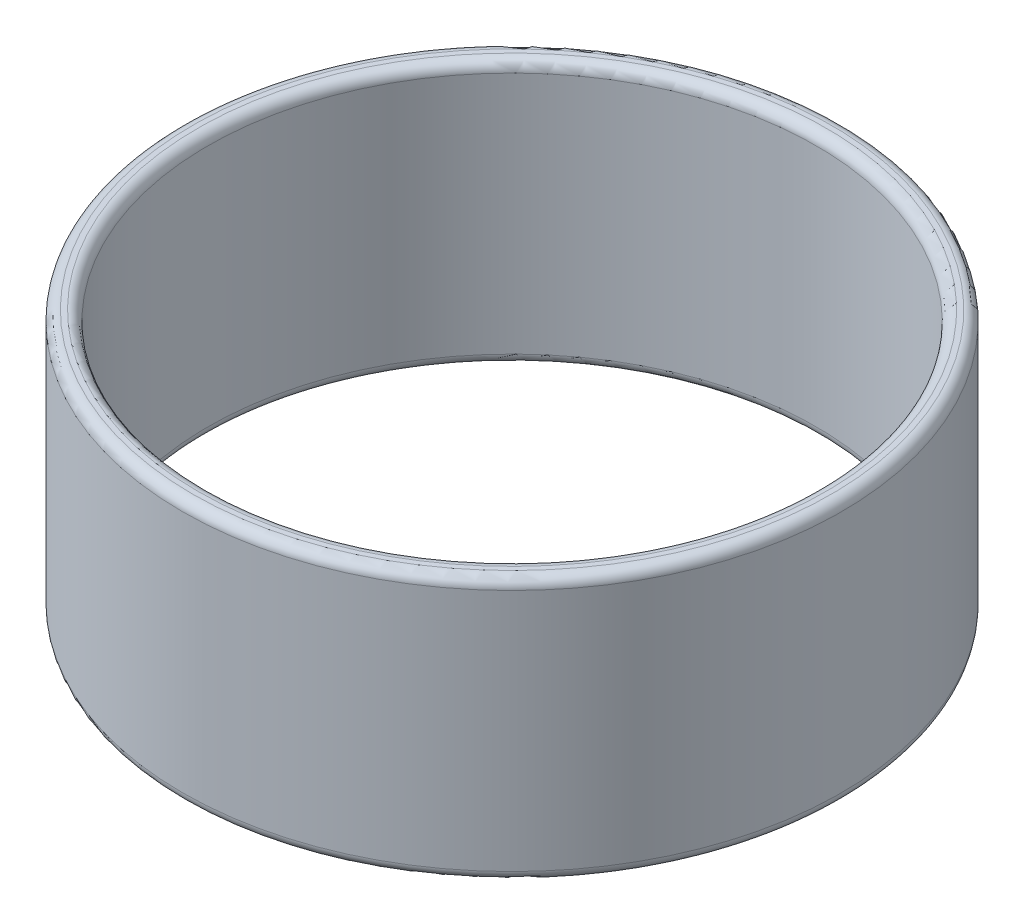
ISO-10303-21;
HEADER;
FILE_DESCRIPTION(('STEP AP214'),'2;1');
FILE_NAME('part.step','',(''),(''),'','','');
FILE_SCHEMA(('AUTOMOTIVE_DESIGN { 1 0 10303 214 1 1 1 1 }'));
ENDSEC;
DATA;
#1=APPLICATION_CONTEXT('core data for automotive mechanical design processes');
#2=APPLICATION_PROTOCOL_DEFINITION('international standard','automotive_design',2000,#1);
#3=PRODUCT_CONTEXT('',#1,'mechanical');
#4=PRODUCT('Part','Part','',(#3));
#5=PRODUCT_RELATED_PRODUCT_CATEGORY('part','',(#4));
#6=PRODUCT_DEFINITION_FORMATION('','',#4);
#7=PRODUCT_DEFINITION_CONTEXT('part definition',#1,'design');
#8=PRODUCT_DEFINITION('design','',#6,#7);
#9=PRODUCT_DEFINITION_SHAPE('','',#8);
#10=(LENGTH_UNIT() NAMED_UNIT(*) SI_UNIT(.MILLI.,.METRE.));
#11=(NAMED_UNIT(*) PLANE_ANGLE_UNIT() SI_UNIT($,.RADIAN.));
#12=(NAMED_UNIT(*) SI_UNIT($,.STERADIAN.) SOLID_ANGLE_UNIT());
#13=UNCERTAINTY_MEASURE_WITH_UNIT(LENGTH_MEASURE(1.E-05),#10,'distance_accuracy_value','');
#14=(GEOMETRIC_REPRESENTATION_CONTEXT(3) GLOBAL_UNCERTAINTY_ASSIGNED_CONTEXT((#13)) GLOBAL_UNIT_ASSIGNED_CONTEXT((#10,
#11,#12)) REPRESENTATION_CONTEXT('',''));
#15=CARTESIAN_POINT('',(0.,0.,0.));
#16=DIRECTION('',(0.,0.,1.));
#17=DIRECTION('',(1.,0.,0.));
#18=AXIS2_PLACEMENT_3D('',#15,#16,#17);
#19=CARTESIAN_POINT('',(0.,26.,0.));
#20=DIRECTION('',(0.,1.,0.));
#21=DIRECTION('',(0.,0.,1.));
#22=AXIS2_PLACEMENT_3D('',#19,#20,#21);
#23=PLANE('',#22);
#24=CARTESIAN_POINT('',(0.,26.,0.));
#25=DIRECTION('',(0.,1.,0.));
#26=DIRECTION('',(0.,0.,1.));
#27=AXIS2_PLACEMENT_3D('',#24,#25,#26);
#28=CIRCLE('',#27,31.);
#29=CARTESIAN_POINT('',(0.,26.,31.));
#30=VERTEX_POINT('',#29);
#31=EDGE_CURVE('E10',#30,#30,#28,.F.);
#32=ORIENTED_EDGE('',*,*,#31,.T.);
#33=EDGE_LOOP('',(#32));
#34=FACE_BOUND('',#33,.T.);
#35=CARTESIAN_POINT('',(0.,26.,0.));
#36=DIRECTION('',(0.,1.,0.));
#37=DIRECTION('',(0.,0.,1.));
#38=AXIS2_PLACEMENT_3D('',#35,#36,#37);
#39=CIRCLE('',#38,31.5);
#40=CARTESIAN_POINT('',(0.,26.,31.5));
#41=VERTEX_POINT('',#40);
#42=EDGE_CURVE('E39',#41,#41,#39,.T.);
#43=ORIENTED_EDGE('',*,*,#42,.T.);
#44=EDGE_LOOP('',(#43));
#45=FACE_BOUND('',#44,.T.);
#46=ADVANCED_FACE('F32',(#34,#45),#23,.T.);
#47=CARTESIAN_POINT('',(0.,0.,0.));
#48=DIRECTION('',(0.,1.,0.));
#49=DIRECTION('',(0.,0.,1.));
#50=AXIS2_PLACEMENT_3D('',#47,#48,#49);
#51=PLANE('',#50);
#52=CARTESIAN_POINT('',(0.,0.,0.));
#53=DIRECTION('',(0.,1.,0.));
#54=DIRECTION('',(0.,0.,1.));
#55=AXIS2_PLACEMENT_3D('',#52,#53,#54);
#56=CIRCLE('',#55,31.);
#57=CARTESIAN_POINT('',(0.,0.,31.));
#58=VERTEX_POINT('',#57);
#59=EDGE_CURVE('E58',#58,#58,#56,.T.);
#60=ORIENTED_EDGE('',*,*,#59,.T.);
#61=EDGE_LOOP('',(#60));
#62=FACE_BOUND('',#61,.T.);
#63=CARTESIAN_POINT('',(0.,0.,0.));
#64=DIRECTION('',(0.,1.,0.));
#65=DIRECTION('',(0.,0.,1.));
#66=AXIS2_PLACEMENT_3D('',#63,#64,#65);
#67=CIRCLE('',#66,31.5);
#68=CARTESIAN_POINT('',(0.,0.,31.5));
#69=VERTEX_POINT('',#68);
#70=EDGE_CURVE('E61',#69,#69,#67,.F.);
#71=ORIENTED_EDGE('',*,*,#70,.T.);
#72=EDGE_LOOP('',(#71));
#73=FACE_BOUND('',#72,.T.);
#74=ADVANCED_FACE('F65',(#62,#73),#51,.F.);
#75=CARTESIAN_POINT('',(0.,26.,0.));
#76=DIRECTION('',(0.,-1.,0.));
#77=DIRECTION('',(0.,0.,-1.));
#78=AXIS2_PLACEMENT_3D('',#75,#76,#77);
#79=CYLINDRICAL_SURFACE('',#78,32.5);
#80=CARTESIAN_POINT('',(0.,1.,0.));
#81=DIRECTION('',(0.,1.,0.));
#82=DIRECTION('',(0.,0.,1.));
#83=AXIS2_PLACEMENT_3D('',#80,#81,#82);
#84=CIRCLE('',#83,32.5);
#85=CARTESIAN_POINT('',(0.,1.,32.5));
#86=VERTEX_POINT('',#85);
#87=EDGE_CURVE('E43',#86,#86,#84,.T.);
#88=ORIENTED_EDGE('',*,*,#87,.T.);
#89=EDGE_LOOP('',(#88));
#90=FACE_BOUND('',#89,.T.);
#91=CARTESIAN_POINT('',(0.,25.,0.));
#92=DIRECTION('',(0.,1.,0.));
#93=DIRECTION('',(0.,0.,1.));
#94=AXIS2_PLACEMENT_3D('',#91,#92,#93);
#95=CIRCLE('',#94,32.5);
#96=CARTESIAN_POINT('',(0.,25.,32.5));
#97=VERTEX_POINT('',#96);
#98=EDGE_CURVE('E47',#97,#97,#95,.F.);
#99=ORIENTED_EDGE('',*,*,#98,.T.);
#100=EDGE_LOOP('',(#99));
#101=FACE_BOUND('',#100,.T.);
#102=ADVANCED_FACE('F75',(#90,#101),#79,.T.);
#103=CARTESIAN_POINT('',(0.,26.,0.));
#104=DIRECTION('',(0.,-1.,0.));
#105=DIRECTION('',(0.,0.,-1.));
#106=AXIS2_PLACEMENT_3D('',#103,#104,#105);
#107=CYLINDRICAL_SURFACE('',#106,30.);
#108=CARTESIAN_POINT('',(0.,1.,0.));
#109=DIRECTION('',(0.,1.,0.));
#110=DIRECTION('',(0.,0.,1.));
#111=AXIS2_PLACEMENT_3D('',#108,#109,#110);
#112=CIRCLE('',#111,30.);
#113=CARTESIAN_POINT('',(0.,1.,30.));
#114=VERTEX_POINT('',#113);
#115=EDGE_CURVE('E52',#114,#114,#112,.F.);
#116=ORIENTED_EDGE('',*,*,#115,.T.);
#117=EDGE_LOOP('',(#116));
#118=FACE_BOUND('',#117,.T.);
#119=CARTESIAN_POINT('',(0.,25.,0.));
#120=DIRECTION('',(0.,1.,0.));
#121=DIRECTION('',(0.,0.,1.));
#122=AXIS2_PLACEMENT_3D('',#119,#120,#121);
#123=CIRCLE('',#122,30.);
#124=CARTESIAN_POINT('',(0.,25.,30.));
#125=VERTEX_POINT('',#124);
#126=EDGE_CURVE('E55',#125,#125,#123,.T.);
#127=ORIENTED_EDGE('',*,*,#126,.T.);
#128=EDGE_LOOP('',(#127));
#129=FACE_BOUND('',#128,.T.);
#130=ADVANCED_FACE('F78',(#118,#129),#107,.F.);
#131=CARTESIAN_POINT('',(0.,1.,0.));
#132=DIRECTION('',(0.,1.,0.));
#133=DIRECTION('',(0.,0.,1.));
#134=AXIS2_PLACEMENT_3D('',#131,#132,#133);
#135=TOROIDAL_SURFACE('',#134,31.,1.);
#136=ORIENTED_EDGE('',*,*,#115,.F.);
#137=EDGE_LOOP('',(#136));
#138=FACE_BOUND('',#137,.T.);
#139=ORIENTED_EDGE('',*,*,#59,.F.);
#140=EDGE_LOOP('',(#139));
#141=FACE_BOUND('',#140,.T.);
#142=ADVANCED_FACE('F71',(#138,#141),#135,.T.);
#143=CARTESIAN_POINT('',(0.,1.,0.));
#144=DIRECTION('',(0.,1.,0.));
#145=DIRECTION('',(0.,0.,1.));
#146=AXIS2_PLACEMENT_3D('',#143,#144,#145);
#147=TOROIDAL_SURFACE('',#146,31.5,1.);
#148=ORIENTED_EDGE('',*,*,#70,.F.);
#149=EDGE_LOOP('',(#148));
#150=FACE_BOUND('',#149,.T.);
#151=ORIENTED_EDGE('',*,*,#87,.F.);
#152=EDGE_LOOP('',(#151));
#153=FACE_BOUND('',#152,.T.);
#154=ADVANCED_FACE('F67',(#150,#153),#147,.T.);
#155=CARTESIAN_POINT('',(0.,25.,0.));
#156=DIRECTION('',(0.,1.,0.));
#157=DIRECTION('',(0.,0.,1.));
#158=AXIS2_PLACEMENT_3D('',#155,#156,#157);
#159=TOROIDAL_SURFACE('',#158,31.,1.);
#160=ORIENTED_EDGE('',*,*,#31,.F.);
#161=EDGE_LOOP('',(#160));
#162=FACE_BOUND('',#161,.T.);
#163=ORIENTED_EDGE('',*,*,#126,.F.);
#164=EDGE_LOOP('',(#163));
#165=FACE_BOUND('',#164,.T.);
#166=ADVANCED_FACE('F70',(#162,#165),#159,.T.);
#167=CARTESIAN_POINT('',(0.,25.,0.));
#168=DIRECTION('',(0.,1.,0.));
#169=DIRECTION('',(0.,0.,1.));
#170=AXIS2_PLACEMENT_3D('',#167,#168,#169);
#171=TOROIDAL_SURFACE('',#170,31.5,1.);
#172=ORIENTED_EDGE('',*,*,#98,.F.);
#173=EDGE_LOOP('',(#172));
#174=FACE_BOUND('',#173,.T.);
#175=ORIENTED_EDGE('',*,*,#42,.F.);
#176=EDGE_LOOP('',(#175));
#177=FACE_BOUND('',#176,.T.);
#178=ADVANCED_FACE('F34',(#174,#177),#171,.T.);
#179=CLOSED_SHELL('',(#46,#74,#102,#130,#142,#154,#166,#178));
#180=MANIFOLD_SOLID_BREP('B2',#179);
#181=ADVANCED_BREP_SHAPE_REPRESENTATION('',(#18,#180),#14);
#182=SHAPE_DEFINITION_REPRESENTATION(#9,#181);
ENDSEC;
END-ISO-10303-21;
